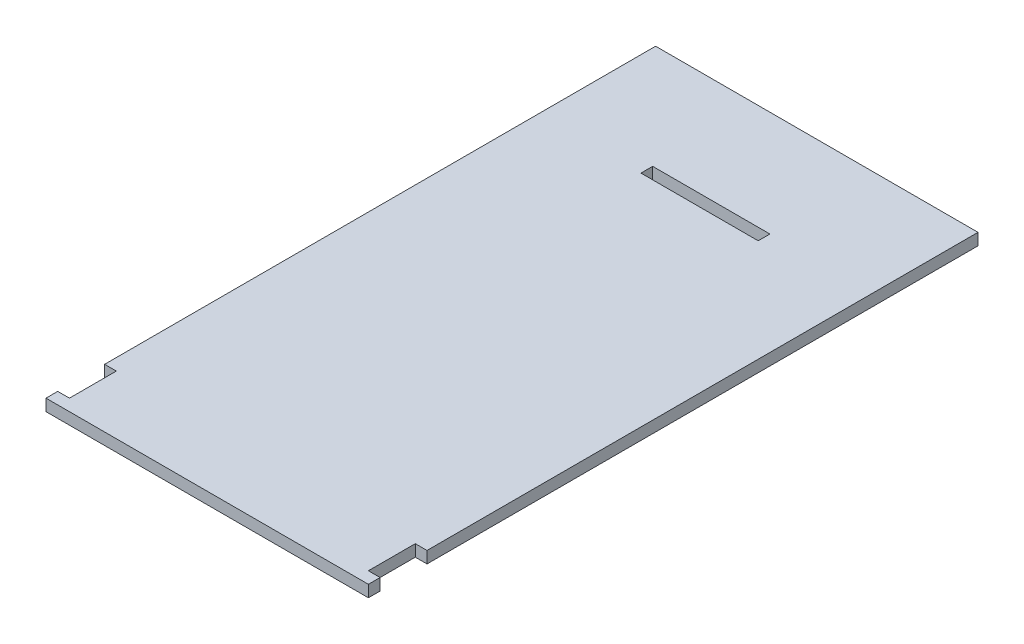
ISO-10303-21;
HEADER;
FILE_DESCRIPTION(('STEP AP214'),'2;1');
FILE_NAME('part.step','',(''),(''),'','','');
FILE_SCHEMA(('AUTOMOTIVE_DESIGN { 1 0 10303 214 1 1 1 1 }'));
ENDSEC;
DATA;
#1=APPLICATION_CONTEXT('core data for automotive mechanical design processes');
#2=APPLICATION_PROTOCOL_DEFINITION('international standard','automotive_design',2000,#1);
#3=PRODUCT_CONTEXT('',#1,'mechanical');
#4=PRODUCT('Part','Part','',(#3));
#5=PRODUCT_RELATED_PRODUCT_CATEGORY('part','',(#4));
#6=PRODUCT_DEFINITION_FORMATION('','',#4);
#7=PRODUCT_DEFINITION_CONTEXT('part definition',#1,'design');
#8=PRODUCT_DEFINITION('design','',#6,#7);
#9=PRODUCT_DEFINITION_SHAPE('','',#8);
#10=(LENGTH_UNIT() NAMED_UNIT(*) SI_UNIT(.MILLI.,.METRE.));
#11=(NAMED_UNIT(*) PLANE_ANGLE_UNIT() SI_UNIT($,.RADIAN.));
#12=(NAMED_UNIT(*) SI_UNIT($,.STERADIAN.) SOLID_ANGLE_UNIT());
#13=UNCERTAINTY_MEASURE_WITH_UNIT(LENGTH_MEASURE(1.E-05),#10,'distance_accuracy_value','');
#14=(GEOMETRIC_REPRESENTATION_CONTEXT(3) GLOBAL_UNCERTAINTY_ASSIGNED_CONTEXT((#13)) GLOBAL_UNIT_ASSIGNED_CONTEXT((#10,
#11,#12)) REPRESENTATION_CONTEXT('',''));
#15=CARTESIAN_POINT('',(0.,0.,0.));
#16=DIRECTION('',(0.,0.,1.));
#17=DIRECTION('',(1.,0.,0.));
#18=AXIS2_PLACEMENT_3D('',#15,#16,#17);
#19=CARTESIAN_POINT('',(0.,2.,0.));
#20=DIRECTION('',(0.,-1.,0.));
#21=DIRECTION('',(0.,0.,-1.));
#22=AXIS2_PLACEMENT_3D('',#19,#20,#21);
#23=PLANE('',#22);
#24=DIRECTION('',(0.,0.,1.));
#25=VECTOR('',#24,1.);
#26=CARTESIAN_POINT('',(0.,2.,0.));
#27=LINE('',#26,#25);
#28=CARTESIAN_POINT('',(0.,2.,-2.));
#29=VERTEX_POINT('',#28);
#30=CARTESIAN_POINT('',(0.,2.,0.));
#31=VERTEX_POINT('',#30);
#32=EDGE_CURVE('E183',#29,#31,#27,.T.);
#33=ORIENTED_EDGE('',*,*,#32,.T.);
#34=DIRECTION('',(1.,0.,0.));
#35=VECTOR('',#34,1.);
#36=CARTESIAN_POINT('',(0.,2.,0.));
#37=LINE('',#36,#35);
#38=CARTESIAN_POINT('',(55.,2.,0.));
#39=VERTEX_POINT('',#38);
#40=EDGE_CURVE('E186',#31,#39,#37,.T.);
#41=ORIENTED_EDGE('',*,*,#40,.T.);
#42=DIRECTION('',(0.,0.,-1.));
#43=VECTOR('',#42,1.);
#44=CARTESIAN_POINT('',(55.,2.,0.));
#45=LINE('',#44,#43);
#46=CARTESIAN_POINT('',(55.,2.,-2.));
#47=VERTEX_POINT('',#46);
#48=EDGE_CURVE('E189',#39,#47,#45,.T.);
#49=ORIENTED_EDGE('',*,*,#48,.T.);
#50=DIRECTION('',(-1.,0.,0.));
#51=VECTOR('',#50,1.);
#52=CARTESIAN_POINT('',(55.,2.,-2.));
#53=LINE('',#52,#51);
#54=CARTESIAN_POINT('',(53.,2.,-2.));
#55=VERTEX_POINT('',#54);
#56=EDGE_CURVE('E191',#47,#55,#53,.T.);
#57=ORIENTED_EDGE('',*,*,#56,.T.);
#58=DIRECTION('',(0.,0.,-1.));
#59=VECTOR('',#58,1.);
#60=CARTESIAN_POINT('',(53.,2.,-2.));
#61=LINE('',#60,#59);
#62=CARTESIAN_POINT('',(53.,2.,-10.));
#63=VERTEX_POINT('',#62);
#64=EDGE_CURVE('E193',#55,#63,#61,.T.);
#65=ORIENTED_EDGE('',*,*,#64,.T.);
#66=DIRECTION('',(1.,0.,0.));
#67=VECTOR('',#66,1.);
#68=CARTESIAN_POINT('',(53.,2.,-10.));
#69=LINE('',#68,#67);
#70=CARTESIAN_POINT('',(55.,2.,-10.));
#71=VERTEX_POINT('',#70);
#72=EDGE_CURVE('E195',#63,#71,#69,.T.);
#73=ORIENTED_EDGE('',*,*,#72,.T.);
#74=DIRECTION('',(0.,0.,-1.));
#75=VECTOR('',#74,1.);
#76=CARTESIAN_POINT('',(55.,2.,-10.));
#77=LINE('',#76,#75);
#78=CARTESIAN_POINT('',(55.,2.,-104.));
#79=VERTEX_POINT('',#78);
#80=EDGE_CURVE('E197',#71,#79,#77,.T.);
#81=ORIENTED_EDGE('',*,*,#80,.T.);
#82=DIRECTION('',(-1.,0.,0.));
#83=VECTOR('',#82,1.);
#84=CARTESIAN_POINT('',(0.,2.,-104.));
#85=LINE('',#84,#83);
#86=CARTESIAN_POINT('',(0.,2.,-104.));
#87=VERTEX_POINT('',#86);
#88=EDGE_CURVE('E199',#79,#87,#85,.T.);
#89=ORIENTED_EDGE('',*,*,#88,.T.);
#90=DIRECTION('',(0.,0.,1.));
#91=VECTOR('',#90,1.);
#92=CARTESIAN_POINT('',(0.,2.,-10.));
#93=LINE('',#92,#91);
#94=CARTESIAN_POINT('',(0.,2.,-10.));
#95=VERTEX_POINT('',#94);
#96=EDGE_CURVE('E201',#87,#95,#93,.T.);
#97=ORIENTED_EDGE('',*,*,#96,.T.);
#98=DIRECTION('',(1.,0.,0.));
#99=VECTOR('',#98,1.);
#100=CARTESIAN_POINT('',(2.,2.,-10.));
#101=LINE('',#100,#99);
#102=CARTESIAN_POINT('',(2.,2.,-10.));
#103=VERTEX_POINT('',#102);
#104=EDGE_CURVE('E203',#95,#103,#101,.T.);
#105=ORIENTED_EDGE('',*,*,#104,.T.);
#106=DIRECTION('',(0.,0.,1.));
#107=VECTOR('',#106,1.);
#108=CARTESIAN_POINT('',(2.,2.,-2.));
#109=LINE('',#108,#107);
#110=CARTESIAN_POINT('',(2.,2.,-2.));
#111=VERTEX_POINT('',#110);
#112=EDGE_CURVE('E205',#103,#111,#109,.T.);
#113=ORIENTED_EDGE('',*,*,#112,.T.);
#114=DIRECTION('',(-1.,0.,0.));
#115=VECTOR('',#114,1.);
#116=CARTESIAN_POINT('',(0.,2.,-2.));
#117=LINE('',#116,#115);
#118=EDGE_CURVE('E207',#111,#29,#117,.T.);
#119=ORIENTED_EDGE('',*,*,#118,.T.);
#120=EDGE_LOOP('',(#33,#41,#49,#57,#65,#73,#81,#89,#97,#105,#113,#119));
#121=FACE_BOUND('',#120,.T.);
#122=DIRECTION('',(0.,0.,1.));
#123=VECTOR('',#122,1.);
#124=CARTESIAN_POINT('',(17.5,2.,-86.));
#125=LINE('',#124,#123);
#126=CARTESIAN_POINT('',(17.5,2.,-86.));
#127=VERTEX_POINT('',#126);
#128=CARTESIAN_POINT('',(17.5,2.,-84.));
#129=VERTEX_POINT('',#128);
#130=EDGE_CURVE('E147',#127,#129,#125,.T.);
#131=ORIENTED_EDGE('',*,*,#130,.F.);
#132=DIRECTION('',(-1.,0.,0.));
#133=VECTOR('',#132,1.);
#134=CARTESIAN_POINT('',(17.5,2.,-86.));
#135=LINE('',#134,#133);
#136=CARTESIAN_POINT('',(37.5,2.,-86.));
#137=VERTEX_POINT('',#136);
#138=EDGE_CURVE('E169',#137,#127,#135,.T.);
#139=ORIENTED_EDGE('',*,*,#138,.F.);
#140=DIRECTION('',(0.,0.,-1.));
#141=VECTOR('',#140,1.);
#142=CARTESIAN_POINT('',(37.5,2.,-86.));
#143=LINE('',#142,#141);
#144=CARTESIAN_POINT('',(37.5,2.,-84.));
#145=VERTEX_POINT('',#144);
#146=EDGE_CURVE('E167',#145,#137,#143,.T.);
#147=ORIENTED_EDGE('',*,*,#146,.F.);
#148=DIRECTION('',(1.,0.,0.));
#149=VECTOR('',#148,1.);
#150=CARTESIAN_POINT('',(17.5,2.,-84.));
#151=LINE('',#150,#149);
#152=EDGE_CURVE('E155',#129,#145,#151,.T.);
#153=ORIENTED_EDGE('',*,*,#152,.F.);
#154=EDGE_LOOP('',(#131,#139,#147,#153));
#155=FACE_BOUND('',#154,.T.);
#156=ADVANCED_FACE('F34',(#121,#155),#23,.F.);
#157=CARTESIAN_POINT('',(0.,0.,0.));
#158=DIRECTION('',(0.,-1.,0.));
#159=DIRECTION('',(0.,0.,-1.));
#160=AXIS2_PLACEMENT_3D('',#157,#158,#159);
#161=PLANE('',#160);
#162=DIRECTION('',(0.,0.,1.));
#163=VECTOR('',#162,1.);
#164=CARTESIAN_POINT('',(0.,0.,0.));
#165=LINE('',#164,#163);
#166=CARTESIAN_POINT('',(0.,0.,-2.));
#167=VERTEX_POINT('',#166);
#168=CARTESIAN_POINT('',(0.,0.,0.));
#169=VERTEX_POINT('',#168);
#170=EDGE_CURVE('E163',#167,#169,#165,.T.);
#171=ORIENTED_EDGE('',*,*,#170,.F.);
#172=DIRECTION('',(-1.,0.,0.));
#173=VECTOR('',#172,1.);
#174=CARTESIAN_POINT('',(0.,0.,-2.));
#175=LINE('',#174,#173);
#176=CARTESIAN_POINT('',(2.,0.,-2.));
#177=VERTEX_POINT('',#176);
#178=EDGE_CURVE('E187',#177,#167,#175,.T.);
#179=ORIENTED_EDGE('',*,*,#178,.F.);
#180=DIRECTION('',(0.,0.,1.));
#181=VECTOR('',#180,1.);
#182=CARTESIAN_POINT('',(2.,0.,-2.));
#183=LINE('',#182,#181);
#184=CARTESIAN_POINT('',(2.,0.,-10.));
#185=VERTEX_POINT('',#184);
#186=EDGE_CURVE('E230',#185,#177,#183,.T.);
#187=ORIENTED_EDGE('',*,*,#186,.F.);
#188=DIRECTION('',(1.,0.,0.));
#189=VECTOR('',#188,1.);
#190=CARTESIAN_POINT('',(2.,0.,-10.));
#191=LINE('',#190,#189);
#192=CARTESIAN_POINT('',(0.,0.,-10.));
#193=VERTEX_POINT('',#192);
#194=EDGE_CURVE('E228',#193,#185,#191,.T.);
#195=ORIENTED_EDGE('',*,*,#194,.F.);
#196=DIRECTION('',(0.,0.,1.));
#197=VECTOR('',#196,1.);
#198=CARTESIAN_POINT('',(0.,0.,-10.));
#199=LINE('',#198,#197);
#200=CARTESIAN_POINT('',(0.,0.,-104.));
#201=VERTEX_POINT('',#200);
#202=EDGE_CURVE('E226',#201,#193,#199,.T.);
#203=ORIENTED_EDGE('',*,*,#202,.F.);
#204=DIRECTION('',(-1.,0.,0.));
#205=VECTOR('',#204,1.);
#206=CARTESIAN_POINT('',(0.,0.,-104.));
#207=LINE('',#206,#205);
#208=CARTESIAN_POINT('',(55.,0.,-104.));
#209=VERTEX_POINT('',#208);
#210=EDGE_CURVE('E224',#209,#201,#207,.T.);
#211=ORIENTED_EDGE('',*,*,#210,.F.);
#212=DIRECTION('',(0.,0.,-1.));
#213=VECTOR('',#212,1.);
#214=CARTESIAN_POINT('',(55.,0.,-10.));
#215=LINE('',#214,#213);
#216=CARTESIAN_POINT('',(55.,0.,-10.));
#217=VERTEX_POINT('',#216);
#218=EDGE_CURVE('E222',#217,#209,#215,.T.);
#219=ORIENTED_EDGE('',*,*,#218,.F.);
#220=DIRECTION('',(1.,0.,0.));
#221=VECTOR('',#220,1.);
#222=CARTESIAN_POINT('',(53.,0.,-10.));
#223=LINE('',#222,#221);
#224=CARTESIAN_POINT('',(53.,0.,-10.));
#225=VERTEX_POINT('',#224);
#226=EDGE_CURVE('E220',#225,#217,#223,.T.);
#227=ORIENTED_EDGE('',*,*,#226,.F.);
#228=DIRECTION('',(0.,0.,-1.));
#229=VECTOR('',#228,1.);
#230=CARTESIAN_POINT('',(53.,0.,-2.));
#231=LINE('',#230,#229);
#232=CARTESIAN_POINT('',(53.,0.,-2.));
#233=VERTEX_POINT('',#232);
#234=EDGE_CURVE('E218',#233,#225,#231,.T.);
#235=ORIENTED_EDGE('',*,*,#234,.F.);
#236=DIRECTION('',(-1.,0.,0.));
#237=VECTOR('',#236,1.);
#238=CARTESIAN_POINT('',(55.,0.,-2.));
#239=LINE('',#238,#237);
#240=CARTESIAN_POINT('',(55.,0.,-2.));
#241=VERTEX_POINT('',#240);
#242=EDGE_CURVE('E216',#241,#233,#239,.T.);
#243=ORIENTED_EDGE('',*,*,#242,.F.);
#244=DIRECTION('',(0.,0.,-1.));
#245=VECTOR('',#244,1.);
#246=CARTESIAN_POINT('',(55.,0.,0.));
#247=LINE('',#246,#245);
#248=CARTESIAN_POINT('',(55.,0.,0.));
#249=VERTEX_POINT('',#248);
#250=EDGE_CURVE('E214',#249,#241,#247,.T.);
#251=ORIENTED_EDGE('',*,*,#250,.F.);
#252=DIRECTION('',(1.,0.,0.));
#253=VECTOR('',#252,1.);
#254=CARTESIAN_POINT('',(0.,0.,0.));
#255=LINE('',#254,#253);
#256=EDGE_CURVE('E212',#169,#249,#255,.T.);
#257=ORIENTED_EDGE('',*,*,#256,.F.);
#258=EDGE_LOOP('',(#171,#179,#187,#195,#203,#211,#219,#227,#235,#243,#251,#257));
#259=FACE_BOUND('',#258,.T.);
#260=DIRECTION('',(-1.,0.,0.));
#261=VECTOR('',#260,1.);
#262=CARTESIAN_POINT('',(17.5,0.,-86.));
#263=LINE('',#262,#261);
#264=CARTESIAN_POINT('',(37.5,0.,-86.));
#265=VERTEX_POINT('',#264);
#266=CARTESIAN_POINT('',(17.5,0.,-86.));
#267=VERTEX_POINT('',#266);
#268=EDGE_CURVE('E156',#265,#267,#263,.T.);
#269=ORIENTED_EDGE('',*,*,#268,.T.);
#270=DIRECTION('',(0.,0.,1.));
#271=VECTOR('',#270,1.);
#272=CARTESIAN_POINT('',(17.5,0.,-86.));
#273=LINE('',#272,#271);
#274=CARTESIAN_POINT('',(17.5,0.,-84.));
#275=VERTEX_POINT('',#274);
#276=EDGE_CURVE('E57',#267,#275,#273,.T.);
#277=ORIENTED_EDGE('',*,*,#276,.T.);
#278=DIRECTION('',(1.,0.,0.));
#279=VECTOR('',#278,1.);
#280=CARTESIAN_POINT('',(17.5,0.,-84.));
#281=LINE('',#280,#279);
#282=CARTESIAN_POINT('',(37.5,0.,-84.));
#283=VERTEX_POINT('',#282);
#284=EDGE_CURVE('E162',#275,#283,#281,.T.);
#285=ORIENTED_EDGE('',*,*,#284,.T.);
#286=DIRECTION('',(0.,0.,-1.));
#287=VECTOR('',#286,1.);
#288=CARTESIAN_POINT('',(37.5,0.,-86.));
#289=LINE('',#288,#287);
#290=EDGE_CURVE('E175',#283,#265,#289,.T.);
#291=ORIENTED_EDGE('',*,*,#290,.T.);
#292=EDGE_LOOP('',(#269,#277,#285,#291));
#293=FACE_BOUND('',#292,.T.);
#294=ADVANCED_FACE('F272',(#259,#293),#161,.T.);
#295=CARTESIAN_POINT('',(0.,2.,0.));
#296=DIRECTION('',(1.,0.,0.));
#297=DIRECTION('',(0.,0.,-1.));
#298=AXIS2_PLACEMENT_3D('',#295,#296,#297);
#299=PLANE('',#298);
#300=ORIENTED_EDGE('',*,*,#170,.T.);
#301=DIRECTION('',(0.,-1.,0.));
#302=VECTOR('',#301,1.);
#303=CARTESIAN_POINT('',(0.,2.,0.));
#304=LINE('',#303,#302);
#305=EDGE_CURVE('E11',#31,#169,#304,.T.);
#306=ORIENTED_EDGE('',*,*,#305,.F.);
#307=ORIENTED_EDGE('',*,*,#32,.F.);
#308=DIRECTION('',(0.,-1.,0.));
#309=VECTOR('',#308,1.);
#310=CARTESIAN_POINT('',(0.,2.,-2.));
#311=LINE('',#310,#309);
#312=EDGE_CURVE('E209',#29,#167,#311,.T.);
#313=ORIENTED_EDGE('',*,*,#312,.T.);
#314=EDGE_LOOP('',(#300,#306,#307,#313));
#315=FACE_BOUND('',#314,.T.);
#316=ADVANCED_FACE('F36',(#315),#299,.F.);
#317=CARTESIAN_POINT('',(0.,2.,0.));
#318=DIRECTION('',(0.,0.,-1.));
#319=DIRECTION('',(-1.,0.,0.));
#320=AXIS2_PLACEMENT_3D('',#317,#318,#319);
#321=PLANE('',#320);
#322=ORIENTED_EDGE('',*,*,#256,.T.);
#323=DIRECTION('',(0.,-1.,0.));
#324=VECTOR('',#323,1.);
#325=CARTESIAN_POINT('',(55.,2.,0.));
#326=LINE('',#325,#324);
#327=EDGE_CURVE('E42',#39,#249,#326,.T.);
#328=ORIENTED_EDGE('',*,*,#327,.F.);
#329=ORIENTED_EDGE('',*,*,#40,.F.);
#330=ORIENTED_EDGE('',*,*,#305,.T.);
#331=EDGE_LOOP('',(#322,#328,#329,#330));
#332=FACE_BOUND('',#331,.T.);
#333=ADVANCED_FACE('F289',(#332),#321,.F.);
#334=CARTESIAN_POINT('',(55.,2.,0.));
#335=DIRECTION('',(-1.,0.,0.));
#336=DIRECTION('',(0.,0.,1.));
#337=AXIS2_PLACEMENT_3D('',#334,#335,#336);
#338=PLANE('',#337);
#339=ORIENTED_EDGE('',*,*,#250,.T.);
#340=DIRECTION('',(0.,-1.,0.));
#341=VECTOR('',#340,1.);
#342=CARTESIAN_POINT('',(55.,2.,-2.));
#343=LINE('',#342,#341);
#344=EDGE_CURVE('E259',#47,#241,#343,.T.);
#345=ORIENTED_EDGE('',*,*,#344,.F.);
#346=ORIENTED_EDGE('',*,*,#48,.F.);
#347=ORIENTED_EDGE('',*,*,#327,.T.);
#348=EDGE_LOOP('',(#339,#345,#346,#347));
#349=FACE_BOUND('',#348,.T.);
#350=ADVANCED_FACE('F266',(#349),#338,.F.);
#351=CARTESIAN_POINT('',(55.,2.,-2.));
#352=DIRECTION('',(0.,0.,1.));
#353=DIRECTION('',(1.,0.,0.));
#354=AXIS2_PLACEMENT_3D('',#351,#352,#353);
#355=PLANE('',#354);
#356=ORIENTED_EDGE('',*,*,#242,.T.);
#357=DIRECTION('',(0.,-1.,0.));
#358=VECTOR('',#357,1.);
#359=CARTESIAN_POINT('',(53.,2.,-2.));
#360=LINE('',#359,#358);
#361=EDGE_CURVE('E256',#55,#233,#360,.T.);
#362=ORIENTED_EDGE('',*,*,#361,.F.);
#363=ORIENTED_EDGE('',*,*,#56,.F.);
#364=ORIENTED_EDGE('',*,*,#344,.T.);
#365=EDGE_LOOP('',(#356,#362,#363,#364));
#366=FACE_BOUND('',#365,.T.);
#367=ADVANCED_FACE('F278',(#366),#355,.F.);
#368=CARTESIAN_POINT('',(53.,2.,-2.));
#369=DIRECTION('',(-1.,0.,0.));
#370=DIRECTION('',(0.,0.,1.));
#371=AXIS2_PLACEMENT_3D('',#368,#369,#370);
#372=PLANE('',#371);
#373=ORIENTED_EDGE('',*,*,#234,.T.);
#374=DIRECTION('',(0.,-1.,0.));
#375=VECTOR('',#374,1.);
#376=CARTESIAN_POINT('',(53.,2.,-10.));
#377=LINE('',#376,#375);
#378=EDGE_CURVE('E253',#63,#225,#377,.T.);
#379=ORIENTED_EDGE('',*,*,#378,.F.);
#380=ORIENTED_EDGE('',*,*,#64,.F.);
#381=ORIENTED_EDGE('',*,*,#361,.T.);
#382=EDGE_LOOP('',(#373,#379,#380,#381));
#383=FACE_BOUND('',#382,.T.);
#384=ADVANCED_FACE('F282',(#383),#372,.F.);
#385=CARTESIAN_POINT('',(53.,2.,-10.));
#386=DIRECTION('',(0.,0.,-1.));
#387=DIRECTION('',(-1.,0.,0.));
#388=AXIS2_PLACEMENT_3D('',#385,#386,#387);
#389=PLANE('',#388);
#390=ORIENTED_EDGE('',*,*,#226,.T.);
#391=DIRECTION('',(0.,-1.,0.));
#392=VECTOR('',#391,1.);
#393=CARTESIAN_POINT('',(55.,2.,-10.));
#394=LINE('',#393,#392);
#395=EDGE_CURVE('E250',#71,#217,#394,.T.);
#396=ORIENTED_EDGE('',*,*,#395,.F.);
#397=ORIENTED_EDGE('',*,*,#72,.F.);
#398=ORIENTED_EDGE('',*,*,#378,.T.);
#399=EDGE_LOOP('',(#390,#396,#397,#398));
#400=FACE_BOUND('',#399,.T.);
#401=ADVANCED_FACE('F322',(#400),#389,.F.);
#402=CARTESIAN_POINT('',(55.,2.,-10.));
#403=DIRECTION('',(-1.,0.,0.));
#404=DIRECTION('',(0.,0.,1.));
#405=AXIS2_PLACEMENT_3D('',#402,#403,#404);
#406=PLANE('',#405);
#407=ORIENTED_EDGE('',*,*,#218,.T.);
#408=DIRECTION('',(0.,-1.,0.));
#409=VECTOR('',#408,1.);
#410=CARTESIAN_POINT('',(55.,2.,-104.));
#411=LINE('',#410,#409);
#412=EDGE_CURVE('E247',#79,#209,#411,.T.);
#413=ORIENTED_EDGE('',*,*,#412,.F.);
#414=ORIENTED_EDGE('',*,*,#80,.F.);
#415=ORIENTED_EDGE('',*,*,#395,.T.);
#416=EDGE_LOOP('',(#407,#413,#414,#415));
#417=FACE_BOUND('',#416,.T.);
#418=ADVANCED_FACE('F320',(#417),#406,.F.);
#419=CARTESIAN_POINT('',(0.,2.,-104.));
#420=DIRECTION('',(0.,0.,1.));
#421=DIRECTION('',(1.,0.,0.));
#422=AXIS2_PLACEMENT_3D('',#419,#420,#421);
#423=PLANE('',#422);
#424=ORIENTED_EDGE('',*,*,#210,.T.);
#425=DIRECTION('',(0.,-1.,0.));
#426=VECTOR('',#425,1.);
#427=CARTESIAN_POINT('',(0.,2.,-104.));
#428=LINE('',#427,#426);
#429=EDGE_CURVE('E244',#87,#201,#428,.T.);
#430=ORIENTED_EDGE('',*,*,#429,.F.);
#431=ORIENTED_EDGE('',*,*,#88,.F.);
#432=ORIENTED_EDGE('',*,*,#412,.T.);
#433=EDGE_LOOP('',(#424,#430,#431,#432));
#434=FACE_BOUND('',#433,.T.);
#435=ADVANCED_FACE('F316',(#434),#423,.F.);
#436=CARTESIAN_POINT('',(0.,2.,-10.));
#437=DIRECTION('',(1.,0.,0.));
#438=DIRECTION('',(0.,0.,-1.));
#439=AXIS2_PLACEMENT_3D('',#436,#437,#438);
#440=PLANE('',#439);
#441=ORIENTED_EDGE('',*,*,#202,.T.);
#442=DIRECTION('',(0.,-1.,0.));
#443=VECTOR('',#442,1.);
#444=CARTESIAN_POINT('',(0.,2.,-10.));
#445=LINE('',#444,#443);
#446=EDGE_CURVE('E241',#95,#193,#445,.T.);
#447=ORIENTED_EDGE('',*,*,#446,.F.);
#448=ORIENTED_EDGE('',*,*,#96,.F.);
#449=ORIENTED_EDGE('',*,*,#429,.T.);
#450=EDGE_LOOP('',(#441,#447,#448,#449));
#451=FACE_BOUND('',#450,.T.);
#452=ADVANCED_FACE('F311',(#451),#440,.F.);
#453=CARTESIAN_POINT('',(2.,2.,-10.));
#454=DIRECTION('',(0.,0.,-1.));
#455=DIRECTION('',(-1.,0.,0.));
#456=AXIS2_PLACEMENT_3D('',#453,#454,#455);
#457=PLANE('',#456);
#458=ORIENTED_EDGE('',*,*,#194,.T.);
#459=DIRECTION('',(0.,-1.,0.));
#460=VECTOR('',#459,1.);
#461=CARTESIAN_POINT('',(2.,2.,-10.));
#462=LINE('',#461,#460);
#463=EDGE_CURVE('E238',#103,#185,#462,.T.);
#464=ORIENTED_EDGE('',*,*,#463,.F.);
#465=ORIENTED_EDGE('',*,*,#104,.F.);
#466=ORIENTED_EDGE('',*,*,#446,.T.);
#467=EDGE_LOOP('',(#458,#464,#465,#466));
#468=FACE_BOUND('',#467,.T.);
#469=ADVANCED_FACE('F305',(#468),#457,.F.);
#470=CARTESIAN_POINT('',(2.,2.,-2.));
#471=DIRECTION('',(1.,0.,0.));
#472=DIRECTION('',(0.,0.,-1.));
#473=AXIS2_PLACEMENT_3D('',#470,#471,#472);
#474=PLANE('',#473);
#475=ORIENTED_EDGE('',*,*,#186,.T.);
#476=DIRECTION('',(0.,-1.,0.));
#477=VECTOR('',#476,1.);
#478=CARTESIAN_POINT('',(2.,2.,-2.));
#479=LINE('',#478,#477);
#480=EDGE_CURVE('E235',#111,#177,#479,.T.);
#481=ORIENTED_EDGE('',*,*,#480,.F.);
#482=ORIENTED_EDGE('',*,*,#112,.F.);
#483=ORIENTED_EDGE('',*,*,#463,.T.);
#484=EDGE_LOOP('',(#475,#481,#482,#483));
#485=FACE_BOUND('',#484,.T.);
#486=ADVANCED_FACE('F301',(#485),#474,.F.);
#487=CARTESIAN_POINT('',(0.,2.,-2.));
#488=DIRECTION('',(0.,0.,1.));
#489=DIRECTION('',(1.,0.,0.));
#490=AXIS2_PLACEMENT_3D('',#487,#488,#489);
#491=PLANE('',#490);
#492=ORIENTED_EDGE('',*,*,#178,.T.);
#493=ORIENTED_EDGE('',*,*,#312,.F.);
#494=ORIENTED_EDGE('',*,*,#118,.F.);
#495=ORIENTED_EDGE('',*,*,#480,.T.);
#496=EDGE_LOOP('',(#492,#493,#494,#495));
#497=FACE_BOUND('',#496,.T.);
#498=ADVANCED_FACE('F296',(#497),#491,.F.);
#499=CARTESIAN_POINT('',(17.5,2.,-86.));
#500=DIRECTION('',(1.,0.,0.));
#501=DIRECTION('',(0.,0.,-1.));
#502=AXIS2_PLACEMENT_3D('',#499,#500,#501);
#503=PLANE('',#502);
#504=ORIENTED_EDGE('',*,*,#276,.F.);
#505=DIRECTION('',(0.,-1.,0.));
#506=VECTOR('',#505,1.);
#507=CARTESIAN_POINT('',(17.5,2.,-86.));
#508=LINE('',#507,#506);
#509=EDGE_CURVE('E151',#127,#267,#508,.T.);
#510=ORIENTED_EDGE('',*,*,#509,.F.);
#511=ORIENTED_EDGE('',*,*,#130,.T.);
#512=DIRECTION('',(0.,-1.,0.));
#513=VECTOR('',#512,1.);
#514=CARTESIAN_POINT('',(17.5,2.,-84.));
#515=LINE('',#514,#513);
#516=EDGE_CURVE('E150',#129,#275,#515,.T.);
#517=ORIENTED_EDGE('',*,*,#516,.T.);
#518=EDGE_LOOP('',(#504,#510,#511,#517));
#519=FACE_BOUND('',#518,.T.);
#520=ADVANCED_FACE('F149',(#519),#503,.T.);
#521=CARTESIAN_POINT('',(17.5,2.,-84.));
#522=DIRECTION('',(0.,0.,-1.));
#523=DIRECTION('',(-1.,0.,0.));
#524=AXIS2_PLACEMENT_3D('',#521,#522,#523);
#525=PLANE('',#524);
#526=ORIENTED_EDGE('',*,*,#284,.F.);
#527=ORIENTED_EDGE('',*,*,#516,.F.);
#528=ORIENTED_EDGE('',*,*,#152,.T.);
#529=DIRECTION('',(0.,-1.,0.));
#530=VECTOR('',#529,1.);
#531=CARTESIAN_POINT('',(37.5,2.,-84.));
#532=LINE('',#531,#530);
#533=EDGE_CURVE('E164',#145,#283,#532,.T.);
#534=ORIENTED_EDGE('',*,*,#533,.T.);
#535=EDGE_LOOP('',(#526,#527,#528,#534));
#536=FACE_BOUND('',#535,.T.);
#537=ADVANCED_FACE('F159',(#536),#525,.T.);
#538=CARTESIAN_POINT('',(37.5,2.,-86.));
#539=DIRECTION('',(-1.,0.,0.));
#540=DIRECTION('',(0.,0.,1.));
#541=AXIS2_PLACEMENT_3D('',#538,#539,#540);
#542=PLANE('',#541);
#543=ORIENTED_EDGE('',*,*,#290,.F.);
#544=ORIENTED_EDGE('',*,*,#533,.F.);
#545=ORIENTED_EDGE('',*,*,#146,.T.);
#546=DIRECTION('',(0.,-1.,0.));
#547=VECTOR('',#546,1.);
#548=CARTESIAN_POINT('',(37.5,2.,-86.));
#549=LINE('',#548,#547);
#550=EDGE_CURVE('E49',#137,#265,#549,.T.);
#551=ORIENTED_EDGE('',*,*,#550,.T.);
#552=EDGE_LOOP('',(#543,#544,#545,#551));
#553=FACE_BOUND('',#552,.T.);
#554=ADVANCED_FACE('F380',(#553),#542,.T.);
#555=CARTESIAN_POINT('',(17.5,2.,-86.));
#556=DIRECTION('',(0.,0.,1.));
#557=DIRECTION('',(1.,0.,0.));
#558=AXIS2_PLACEMENT_3D('',#555,#556,#557);
#559=PLANE('',#558);
#560=ORIENTED_EDGE('',*,*,#268,.F.);
#561=ORIENTED_EDGE('',*,*,#550,.F.);
#562=ORIENTED_EDGE('',*,*,#138,.T.);
#563=ORIENTED_EDGE('',*,*,#509,.T.);
#564=EDGE_LOOP('',(#560,#561,#562,#563));
#565=FACE_BOUND('',#564,.T.);
#566=ADVANCED_FACE('F386',(#565),#559,.T.);
#567=CLOSED_SHELL('',(#156,#294,#316,#333,#350,#367,#384,#401,#418,#435,#452,#469,#486,#498,
#520,#537,#554,#566));
#568=MANIFOLD_SOLID_BREP('B2',#567);
#569=ADVANCED_BREP_SHAPE_REPRESENTATION('',(#18,#568),#14);
#570=SHAPE_DEFINITION_REPRESENTATION(#9,#569);
ENDSEC;
END-ISO-10303-21;
